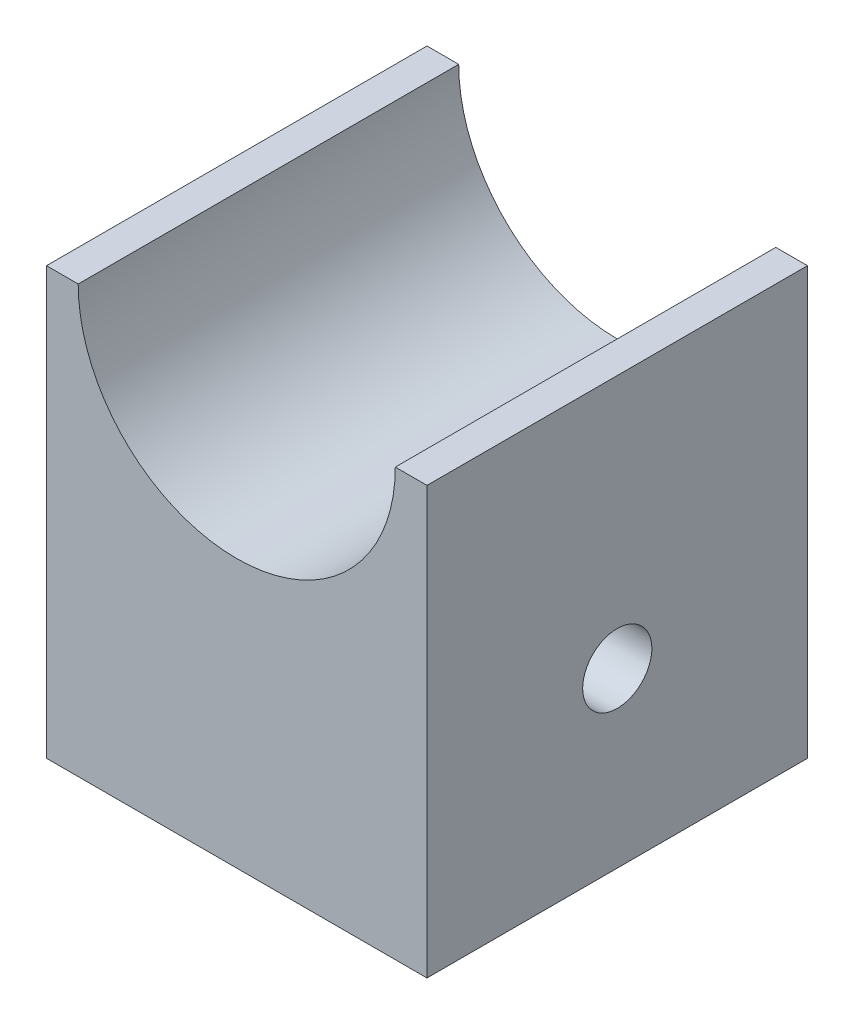
ISO-10303-21;
HEADER;
FILE_DESCRIPTION(('STEP AP214'),'2;1');
FILE_NAME('part.step','',(''),(''),'','','');
FILE_SCHEMA(('AUTOMOTIVE_DESIGN { 1 0 10303 214 1 1 1 1 }'));
ENDSEC;
DATA;
#1=APPLICATION_CONTEXT('core data for automotive mechanical design processes');
#2=APPLICATION_PROTOCOL_DEFINITION('international standard','automotive_design',2000,#1);
#3=PRODUCT_CONTEXT('',#1,'mechanical');
#4=PRODUCT('Part','Part','',(#3));
#5=PRODUCT_RELATED_PRODUCT_CATEGORY('part','',(#4));
#6=PRODUCT_DEFINITION_FORMATION('','',#4);
#7=PRODUCT_DEFINITION_CONTEXT('part definition',#1,'design');
#8=PRODUCT_DEFINITION('design','',#6,#7);
#9=PRODUCT_DEFINITION_SHAPE('','',#8);
#10=(LENGTH_UNIT() NAMED_UNIT(*) SI_UNIT(.MILLI.,.METRE.));
#11=(NAMED_UNIT(*) PLANE_ANGLE_UNIT() SI_UNIT($,.RADIAN.));
#12=(NAMED_UNIT(*) SI_UNIT($,.STERADIAN.) SOLID_ANGLE_UNIT());
#13=UNCERTAINTY_MEASURE_WITH_UNIT(LENGTH_MEASURE(1.E-05),#10,'distance_accuracy_value','');
#14=(GEOMETRIC_REPRESENTATION_CONTEXT(3) GLOBAL_UNCERTAINTY_ASSIGNED_CONTEXT((#13)) GLOBAL_UNIT_ASSIGNED_CONTEXT((#10,
#11,#12)) REPRESENTATION_CONTEXT('',''));
#15=CARTESIAN_POINT('',(0.,0.,0.));
#16=DIRECTION('',(0.,0.,1.));
#17=DIRECTION('',(1.,0.,0.));
#18=AXIS2_PLACEMENT_3D('',#15,#16,#17);
#19=CARTESIAN_POINT('',(0.,37.,33.));
#20=DIRECTION('',(0.,-1.,0.));
#21=DIRECTION('',(1.,0.,0.));
#22=AXIS2_PLACEMENT_3D('',#19,#20,#21);
#23=PLANE('',#22);
#24=DIRECTION('',(-1.,0.,0.));
#25=VECTOR('',#24,1.);
#26=CARTESIAN_POINT('',(0.,37.,0.));
#27=LINE('',#26,#25);
#28=CARTESIAN_POINT('',(0.,37.,0.));
#29=VERTEX_POINT('',#28);
#30=CARTESIAN_POINT('',(-2.75,37.,0.));
#31=VERTEX_POINT('',#30);
#32=EDGE_CURVE('E111',#29,#31,#27,.T.);
#33=ORIENTED_EDGE('',*,*,#32,.T.);
#34=DIRECTION('',(0.,0.,1.));
#35=VECTOR('',#34,1.);
#36=CARTESIAN_POINT('',(-2.75,37.,0.));
#37=LINE('',#36,#35);
#38=CARTESIAN_POINT('',(-2.75,37.,33.));
#39=VERTEX_POINT('',#38);
#40=EDGE_CURVE('E48',#31,#39,#37,.T.);
#41=ORIENTED_EDGE('',*,*,#40,.T.);
#42=DIRECTION('',(-1.,0.,0.));
#43=VECTOR('',#42,1.);
#44=CARTESIAN_POINT('',(0.,37.,33.));
#45=LINE('',#44,#43);
#46=CARTESIAN_POINT('',(0.,37.,33.));
#47=VERTEX_POINT('',#46);
#48=EDGE_CURVE('E84',#47,#39,#45,.T.);
#49=ORIENTED_EDGE('',*,*,#48,.F.);
#50=DIRECTION('',(0.,0.,-1.));
#51=VECTOR('',#50,1.);
#52=CARTESIAN_POINT('',(0.,37.,33.));
#53=LINE('',#52,#51);
#54=EDGE_CURVE('E41',#47,#29,#53,.T.);
#55=ORIENTED_EDGE('',*,*,#54,.T.);
#56=EDGE_LOOP('',(#33,#41,#49,#55));
#57=FACE_BOUND('',#56,.T.);
#58=ADVANCED_FACE('F33',(#57),#23,.F.);
#59=CARTESIAN_POINT('',(0.,0.,33.));
#60=DIRECTION('',(-1.,0.,0.));
#61=DIRECTION('',(0.,-1.,0.));
#62=AXIS2_PLACEMENT_3D('',#59,#60,#61);
#63=PLANE('',#62);
#64=CARTESIAN_POINT('',(0.,15.,16.5));
#65=DIRECTION('',(-1.,0.,0.));
#66=DIRECTION('',(0.,0.,1.));
#67=AXIS2_PLACEMENT_3D('',#64,#65,#66);
#68=CIRCLE('',#67,3.);
#69=CARTESIAN_POINT('',(0.,15.,19.5));
#70=VERTEX_POINT('',#69);
#71=EDGE_CURVE('E139',#70,#70,#68,.T.);
#72=ORIENTED_EDGE('',*,*,#71,.T.);
#73=EDGE_LOOP('',(#72));
#74=FACE_BOUND('',#73,.T.);
#75=DIRECTION('',(0.,1.,0.));
#76=VECTOR('',#75,1.);
#77=CARTESIAN_POINT('',(0.,0.,0.));
#78=LINE('',#77,#76);
#79=CARTESIAN_POINT('',(0.,0.,0.));
#80=VERTEX_POINT('',#79);
#81=EDGE_CURVE('E112',#80,#29,#78,.T.);
#82=ORIENTED_EDGE('',*,*,#81,.T.);
#83=ORIENTED_EDGE('',*,*,#54,.F.);
#84=DIRECTION('',(0.,1.,0.));
#85=VECTOR('',#84,1.);
#86=CARTESIAN_POINT('',(0.,0.,33.));
#87=LINE('',#86,#85);
#88=CARTESIAN_POINT('',(0.,0.,33.));
#89=VERTEX_POINT('',#88);
#90=EDGE_CURVE('E120',#89,#47,#87,.T.);
#91=ORIENTED_EDGE('',*,*,#90,.F.);
#92=DIRECTION('',(0.,0.,-1.));
#93=VECTOR('',#92,1.);
#94=CARTESIAN_POINT('',(0.,0.,33.));
#95=LINE('',#94,#93);
#96=EDGE_CURVE('E121',#89,#80,#95,.T.);
#97=ORIENTED_EDGE('',*,*,#96,.T.);
#98=EDGE_LOOP('',(#82,#83,#91,#97));
#99=FACE_BOUND('',#98,.T.);
#100=ADVANCED_FACE('F35',(#74,#99),#63,.F.);
#101=CARTESIAN_POINT('',(-30.25,37.,33.));
#102=VERTEX_POINT('',#101);
#103=CARTESIAN_POINT('',(-33.,37.,33.));
#104=VERTEX_POINT('',#103);
#105=EDGE_CURVE('E105',#102,#104,#45,.T.);
#106=ORIENTED_EDGE('',*,*,#105,.F.);
#107=DIRECTION('',(0.,0.,1.));
#108=VECTOR('',#107,1.);
#109=CARTESIAN_POINT('',(-30.25,37.,0.));
#110=LINE('',#109,#108);
#111=CARTESIAN_POINT('',(-30.25,37.,0.));
#112=VERTEX_POINT('',#111);
#113=EDGE_CURVE('E94',#102,#112,#110,.F.);
#114=ORIENTED_EDGE('',*,*,#113,.T.);
#115=CARTESIAN_POINT('',(-33.,37.,0.));
#116=VERTEX_POINT('',#115);
#117=EDGE_CURVE('E103',#112,#116,#27,.T.);
#118=ORIENTED_EDGE('',*,*,#117,.T.);
#119=DIRECTION('',(0.,0.,-1.));
#120=VECTOR('',#119,1.);
#121=CARTESIAN_POINT('',(-33.,37.,33.));
#122=LINE('',#121,#120);
#123=EDGE_CURVE('E125',#104,#116,#122,.T.);
#124=ORIENTED_EDGE('',*,*,#123,.F.);
#125=EDGE_LOOP('',(#106,#114,#118,#124));
#126=FACE_BOUND('',#125,.T.);
#127=ADVANCED_FACE('F101',(#126),#23,.F.);
#128=CARTESIAN_POINT('',(-33.,0.,33.));
#129=DIRECTION('',(1.,0.,0.));
#130=DIRECTION('',(0.,0.,-1.));
#131=AXIS2_PLACEMENT_3D('',#128,#129,#130);
#132=PLANE('',#131);
#133=CARTESIAN_POINT('',(-33.,15.,16.5));
#134=DIRECTION('',(-1.,0.,0.));
#135=DIRECTION('',(0.,0.,1.));
#136=AXIS2_PLACEMENT_3D('',#133,#134,#135);
#137=CIRCLE('',#136,3.);
#138=CARTESIAN_POINT('',(-33.,15.,19.5));
#139=VERTEX_POINT('',#138);
#140=EDGE_CURVE('E140',#139,#139,#137,.T.);
#141=ORIENTED_EDGE('',*,*,#140,.F.);
#142=EDGE_LOOP('',(#141));
#143=FACE_BOUND('',#142,.T.);
#144=DIRECTION('',(0.,-1.,0.));
#145=VECTOR('',#144,1.);
#146=CARTESIAN_POINT('',(-33.,0.,0.));
#147=LINE('',#146,#145);
#148=CARTESIAN_POINT('',(-33.,0.,0.));
#149=VERTEX_POINT('',#148);
#150=EDGE_CURVE('E110',#116,#149,#147,.T.);
#151=ORIENTED_EDGE('',*,*,#150,.T.);
#152=DIRECTION('',(0.,0.,-1.));
#153=VECTOR('',#152,1.);
#154=CARTESIAN_POINT('',(-33.,0.,33.));
#155=LINE('',#154,#153);
#156=CARTESIAN_POINT('',(-33.,0.,33.));
#157=VERTEX_POINT('',#156);
#158=EDGE_CURVE('E123',#157,#149,#155,.T.);
#159=ORIENTED_EDGE('',*,*,#158,.F.);
#160=DIRECTION('',(0.,-1.,0.));
#161=VECTOR('',#160,1.);
#162=CARTESIAN_POINT('',(-33.,0.,33.));
#163=LINE('',#162,#161);
#164=EDGE_CURVE('E132',#104,#157,#163,.T.);
#165=ORIENTED_EDGE('',*,*,#164,.F.);
#166=ORIENTED_EDGE('',*,*,#123,.T.);
#167=EDGE_LOOP('',(#151,#159,#165,#166));
#168=FACE_BOUND('',#167,.T.);
#169=ADVANCED_FACE('F153',(#143,#168),#132,.F.);
#170=CARTESIAN_POINT('',(0.,0.,33.));
#171=DIRECTION('',(0.,1.,0.));
#172=DIRECTION('',(-1.,0.,0.));
#173=AXIS2_PLACEMENT_3D('',#170,#171,#172);
#174=PLANE('',#173);
#175=DIRECTION('',(1.,0.,0.));
#176=VECTOR('',#175,1.);
#177=CARTESIAN_POINT('',(0.,0.,0.));
#178=LINE('',#177,#176);
#179=EDGE_CURVE('E77',#149,#80,#178,.T.);
#180=ORIENTED_EDGE('',*,*,#179,.T.);
#181=ORIENTED_EDGE('',*,*,#96,.F.);
#182=DIRECTION('',(1.,0.,0.));
#183=VECTOR('',#182,1.);
#184=CARTESIAN_POINT('',(0.,0.,33.));
#185=LINE('',#184,#183);
#186=EDGE_CURVE('E56',#157,#89,#185,.T.);
#187=ORIENTED_EDGE('',*,*,#186,.F.);
#188=ORIENTED_EDGE('',*,*,#158,.T.);
#189=EDGE_LOOP('',(#180,#181,#187,#188));
#190=FACE_BOUND('',#189,.T.);
#191=ADVANCED_FACE('F130',(#190),#174,.F.);
#192=CARTESIAN_POINT('',(0.,0.,33.));
#193=DIRECTION('',(0.,0.,1.));
#194=DIRECTION('',(1.,0.,0.));
#195=AXIS2_PLACEMENT_3D('',#192,#193,#194);
#196=PLANE('',#195);
#197=CARTESIAN_POINT('',(-16.5,37.,33.));
#198=DIRECTION('',(0.,0.,1.));
#199=DIRECTION('',(1.,0.,0.));
#200=AXIS2_PLACEMENT_3D('',#197,#198,#199);
#201=CIRCLE('',#200,13.75);
#202=EDGE_CURVE('E106',#102,#39,#201,.T.);
#203=ORIENTED_EDGE('',*,*,#202,.F.);
#204=ORIENTED_EDGE('',*,*,#105,.T.);
#205=ORIENTED_EDGE('',*,*,#164,.T.);
#206=ORIENTED_EDGE('',*,*,#186,.T.);
#207=ORIENTED_EDGE('',*,*,#90,.T.);
#208=ORIENTED_EDGE('',*,*,#48,.T.);
#209=EDGE_LOOP('',(#203,#204,#205,#206,#207,#208));
#210=FACE_BOUND('',#209,.T.);
#211=ADVANCED_FACE('F158',(#210),#196,.T.);
#212=CARTESIAN_POINT('',(0.,0.,0.));
#213=DIRECTION('',(0.,0.,1.));
#214=DIRECTION('',(1.,0.,0.));
#215=AXIS2_PLACEMENT_3D('',#212,#213,#214);
#216=PLANE('',#215);
#217=ORIENTED_EDGE('',*,*,#117,.F.);
#218=CARTESIAN_POINT('',(-16.5,37.,0.));
#219=DIRECTION('',(0.,0.,1.));
#220=DIRECTION('',(1.,0.,0.));
#221=AXIS2_PLACEMENT_3D('',#218,#219,#220);
#222=CIRCLE('',#221,13.75);
#223=EDGE_CURVE('E11',#112,#31,#222,.T.);
#224=ORIENTED_EDGE('',*,*,#223,.T.);
#225=ORIENTED_EDGE('',*,*,#32,.F.);
#226=ORIENTED_EDGE('',*,*,#81,.F.);
#227=ORIENTED_EDGE('',*,*,#179,.F.);
#228=ORIENTED_EDGE('',*,*,#150,.F.);
#229=EDGE_LOOP('',(#217,#224,#225,#226,#227,#228));
#230=FACE_BOUND('',#229,.T.);
#231=ADVANCED_FACE('F109',(#230),#216,.F.);
#232=CARTESIAN_POINT('',(-16.5,37.,0.));
#233=DIRECTION('',(0.,0.,1.));
#234=DIRECTION('',(1.,0.,0.));
#235=AXIS2_PLACEMENT_3D('',#232,#233,#234);
#236=CYLINDRICAL_SURFACE('',#235,13.75);
#237=ORIENTED_EDGE('',*,*,#223,.F.);
#238=ORIENTED_EDGE('',*,*,#113,.F.);
#239=ORIENTED_EDGE('',*,*,#202,.T.);
#240=ORIENTED_EDGE('',*,*,#40,.F.);
#241=EDGE_LOOP('',(#237,#238,#239,#240));
#242=FACE_BOUND('',#241,.T.);
#243=ADVANCED_FACE('F93',(#242),#236,.F.);
#244=CARTESIAN_POINT('',(0.,15.,16.5));
#245=DIRECTION('',(-1.,0.,0.));
#246=DIRECTION('',(0.,0.,1.));
#247=AXIS2_PLACEMENT_3D('',#244,#245,#246);
#248=CYLINDRICAL_SURFACE('',#247,3.);
#249=ORIENTED_EDGE('',*,*,#71,.F.);
#250=EDGE_LOOP('',(#249));
#251=FACE_BOUND('',#250,.T.);
#252=ORIENTED_EDGE('',*,*,#140,.T.);
#253=EDGE_LOOP('',(#252));
#254=FACE_BOUND('',#253,.T.);
#255=ADVANCED_FACE('F147',(#251,#254),#248,.F.);
#256=CLOSED_SHELL('',(#58,#100,#127,#169,#191,#211,#231,#243,#255));
#257=MANIFOLD_SOLID_BREP('B2',#256);
#258=ADVANCED_BREP_SHAPE_REPRESENTATION('',(#18,#257),#14);
#259=SHAPE_DEFINITION_REPRESENTATION(#9,#258);
ENDSEC;
END-ISO-10303-21;
